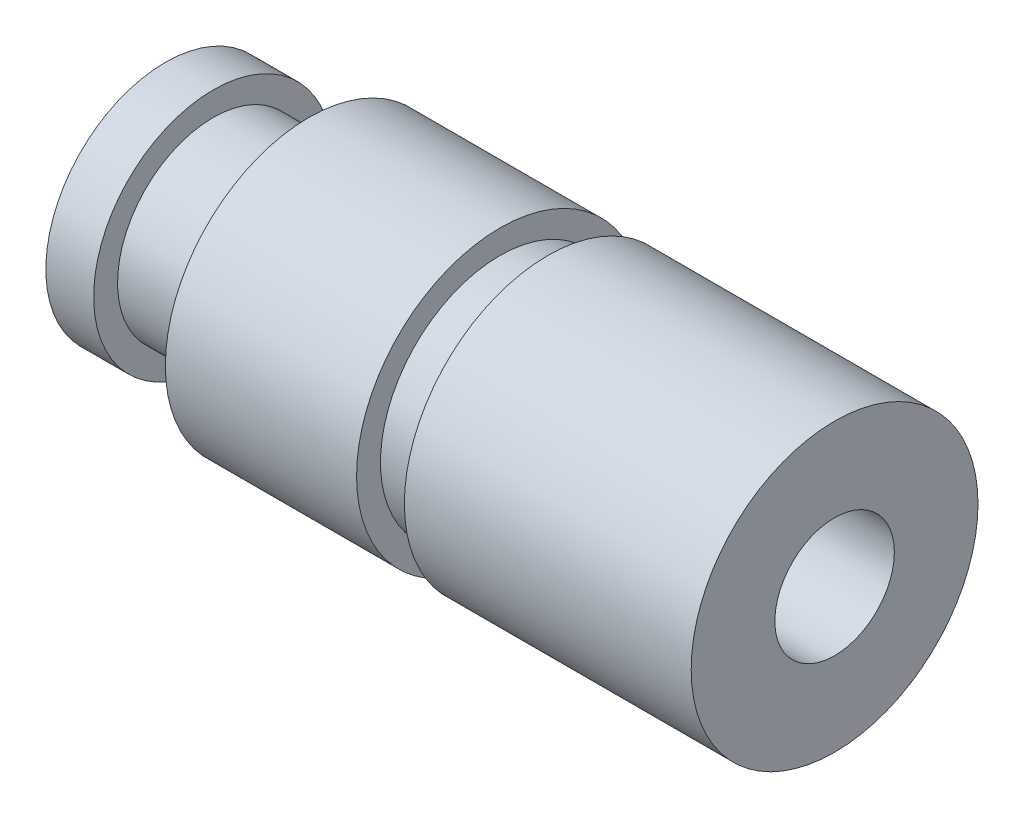
ISO-10303-21;
HEADER;
FILE_DESCRIPTION(('STEP AP214'),'2;1');
FILE_NAME('part.step','',(''),(''),'','','');
FILE_SCHEMA(('AUTOMOTIVE_DESIGN { 1 0 10303 214 1 1 1 1 }'));
ENDSEC;
DATA;
#1=APPLICATION_CONTEXT('core data for automotive mechanical design processes');
#2=APPLICATION_PROTOCOL_DEFINITION('international standard','automotive_design',2000,#1);
#3=PRODUCT_CONTEXT('',#1,'mechanical');
#4=PRODUCT('Part','Part','',(#3));
#5=PRODUCT_RELATED_PRODUCT_CATEGORY('part','',(#4));
#6=PRODUCT_DEFINITION_FORMATION('','',#4);
#7=PRODUCT_DEFINITION_CONTEXT('part definition',#1,'design');
#8=PRODUCT_DEFINITION('design','',#6,#7);
#9=PRODUCT_DEFINITION_SHAPE('','',#8);
#10=(LENGTH_UNIT() NAMED_UNIT(*) SI_UNIT(.MILLI.,.METRE.));
#11=(NAMED_UNIT(*) PLANE_ANGLE_UNIT() SI_UNIT($,.RADIAN.));
#12=(NAMED_UNIT(*) SI_UNIT($,.STERADIAN.) SOLID_ANGLE_UNIT());
#13=UNCERTAINTY_MEASURE_WITH_UNIT(LENGTH_MEASURE(1.E-05),#10,'distance_accuracy_value','');
#14=(GEOMETRIC_REPRESENTATION_CONTEXT(3) GLOBAL_UNCERTAINTY_ASSIGNED_CONTEXT((#13)) GLOBAL_UNIT_ASSIGNED_CONTEXT((#10,
#11,#12)) REPRESENTATION_CONTEXT('',''));
#15=CARTESIAN_POINT('',(0.,0.,0.));
#16=DIRECTION('',(0.,0.,1.));
#17=DIRECTION('',(1.,0.,0.));
#18=AXIS2_PLACEMENT_3D('',#15,#16,#17);
#19=CARTESIAN_POINT('',(0.,0.,0.));
#20=DIRECTION('',(-1.,0.,0.));
#21=DIRECTION('',(0.,-1.,0.));
#22=AXIS2_PLACEMENT_3D('',#19,#20,#21);
#23=PLANE('',#22);
#24=CARTESIAN_POINT('',(0.,0.,0.));
#25=DIRECTION('',(1.,0.,0.));
#26=DIRECTION('',(0.,1.,0.));
#27=AXIS2_PLACEMENT_3D('',#24,#25,#26);
#28=CIRCLE('',#27,2.5);
#29=CARTESIAN_POINT('',(0.,2.5,0.));
#30=VERTEX_POINT('',#29);
#31=EDGE_CURVE('E11',#30,#30,#28,.T.);
#32=ORIENTED_EDGE('',*,*,#31,.F.);
#33=EDGE_LOOP('',(#32));
#34=FACE_BOUND('',#33,.T.);
#35=ADVANCED_FACE('F42',(#34),#23,.T.);
#36=CARTESIAN_POINT('',(14.,0.,0.));
#37=DIRECTION('',(1.,0.,0.));
#38=DIRECTION('',(0.,1.,0.));
#39=AXIS2_PLACEMENT_3D('',#36,#37,#38);
#40=CYLINDRICAL_SURFACE('',#39,2.5);
#41=ORIENTED_EDGE('',*,*,#31,.T.);
#42=EDGE_LOOP('',(#41));
#43=FACE_BOUND('',#42,.T.);
#44=CARTESIAN_POINT('',(1.,0.,0.));
#45=DIRECTION('',(1.,0.,0.));
#46=DIRECTION('',(0.,1.,0.));
#47=AXIS2_PLACEMENT_3D('',#44,#45,#46);
#48=CIRCLE('',#47,2.5);
#49=CARTESIAN_POINT('',(1.,2.5,0.));
#50=VERTEX_POINT('',#49);
#51=EDGE_CURVE('E48',#50,#50,#48,.T.);
#52=ORIENTED_EDGE('',*,*,#51,.F.);
#53=EDGE_LOOP('',(#52));
#54=FACE_BOUND('',#53,.T.);
#55=ADVANCED_FACE('F89',(#43,#54),#40,.T.);
#56=CARTESIAN_POINT('',(1.,2.5,0.));
#57=DIRECTION('',(1.,0.,0.));
#58=DIRECTION('',(0.,1.,0.));
#59=AXIS2_PLACEMENT_3D('',#56,#57,#58);
#60=PLANE('',#59);
#61=ORIENTED_EDGE('',*,*,#51,.T.);
#62=EDGE_LOOP('',(#61));
#63=FACE_BOUND('',#62,.T.);
#64=CARTESIAN_POINT('',(1.,0.,0.));
#65=DIRECTION('',(1.,0.,0.));
#66=DIRECTION('',(0.,1.,0.));
#67=AXIS2_PLACEMENT_3D('',#64,#65,#66);
#68=CIRCLE('',#67,2.);
#69=CARTESIAN_POINT('',(1.,2.,0.));
#70=VERTEX_POINT('',#69);
#71=EDGE_CURVE('E81',#70,#70,#68,.T.);
#72=ORIENTED_EDGE('',*,*,#71,.F.);
#73=EDGE_LOOP('',(#72));
#74=FACE_BOUND('',#73,.T.);
#75=ADVANCED_FACE('F86',(#63,#74),#60,.T.);
#76=CARTESIAN_POINT('',(14.,0.,0.));
#77=DIRECTION('',(1.,0.,0.));
#78=DIRECTION('',(0.,1.,0.));
#79=AXIS2_PLACEMENT_3D('',#76,#77,#78);
#80=CYLINDRICAL_SURFACE('',#79,2.);
#81=ORIENTED_EDGE('',*,*,#71,.T.);
#82=EDGE_LOOP('',(#81));
#83=FACE_BOUND('',#82,.T.);
#84=CARTESIAN_POINT('',(3.,0.,0.));
#85=DIRECTION('',(1.,0.,0.));
#86=DIRECTION('',(0.,1.,0.));
#87=AXIS2_PLACEMENT_3D('',#84,#85,#86);
#88=CIRCLE('',#87,2.);
#89=CARTESIAN_POINT('',(3.,2.,0.));
#90=VERTEX_POINT('',#89);
#91=EDGE_CURVE('E78',#90,#90,#88,.T.);
#92=ORIENTED_EDGE('',*,*,#91,.F.);
#93=EDGE_LOOP('',(#92));
#94=FACE_BOUND('',#93,.T.);
#95=ADVANCED_FACE('F96',(#83,#94),#80,.T.);
#96=CARTESIAN_POINT('',(3.,2.,0.));
#97=DIRECTION('',(-1.,0.,0.));
#98=DIRECTION('',(0.,-1.,0.));
#99=AXIS2_PLACEMENT_3D('',#96,#97,#98);
#100=PLANE('',#99);
#101=ORIENTED_EDGE('',*,*,#91,.T.);
#102=EDGE_LOOP('',(#101));
#103=FACE_BOUND('',#102,.T.);
#104=CARTESIAN_POINT('',(3.,0.,0.));
#105=DIRECTION('',(1.,0.,0.));
#106=DIRECTION('',(0.,1.,0.));
#107=AXIS2_PLACEMENT_3D('',#104,#105,#106);
#108=CIRCLE('',#107,3.);
#109=CARTESIAN_POINT('',(3.,3.,0.));
#110=VERTEX_POINT('',#109);
#111=EDGE_CURVE('E75',#110,#110,#108,.T.);
#112=ORIENTED_EDGE('',*,*,#111,.F.);
#113=EDGE_LOOP('',(#112));
#114=FACE_BOUND('',#113,.T.);
#115=ADVANCED_FACE('F102',(#103,#114),#100,.T.);
#116=CARTESIAN_POINT('',(14.,0.,0.));
#117=DIRECTION('',(1.,0.,0.));
#118=DIRECTION('',(0.,1.,0.));
#119=AXIS2_PLACEMENT_3D('',#116,#117,#118);
#120=CYLINDRICAL_SURFACE('',#119,3.);
#121=CARTESIAN_POINT('',(7.,0.,0.));
#122=DIRECTION('',(-1.,0.,0.));
#123=DIRECTION('',(0.,-1.,0.));
#124=AXIS2_PLACEMENT_3D('',#121,#122,#123);
#125=CIRCLE('',#124,3.);
#126=CARTESIAN_POINT('',(7.,-3.,0.));
#127=VERTEX_POINT('',#126);
#128=EDGE_CURVE('E68',#127,#127,#125,.T.);
#129=ORIENTED_EDGE('',*,*,#128,.T.);
#130=EDGE_LOOP('',(#129));
#131=FACE_BOUND('',#130,.T.);
#132=ORIENTED_EDGE('',*,*,#111,.T.);
#133=EDGE_LOOP('',(#132));
#134=FACE_BOUND('',#133,.T.);
#135=ADVANCED_FACE('F106',(#131,#134),#120,.T.);
#136=CARTESIAN_POINT('',(8.,0.,0.));
#137=DIRECTION('',(-1.,0.,0.));
#138=DIRECTION('',(0.,-1.,0.));
#139=AXIS2_PLACEMENT_3D('',#136,#137,#138);
#140=PLANE('',#139);
#141=CARTESIAN_POINT('',(8.,0.,0.));
#142=DIRECTION('',(-1.,0.,0.));
#143=DIRECTION('',(0.,-1.,0.));
#144=AXIS2_PLACEMENT_3D('',#141,#142,#143);
#145=CIRCLE('',#144,2.5);
#146=CARTESIAN_POINT('',(8.,-2.5,0.));
#147=VERTEX_POINT('',#146);
#148=EDGE_CURVE('E133',#147,#147,#145,.T.);
#149=ORIENTED_EDGE('',*,*,#148,.F.);
#150=EDGE_LOOP('',(#149));
#151=FACE_BOUND('',#150,.T.);
#152=CARTESIAN_POINT('',(8.,0.,0.));
#153=DIRECTION('',(-1.,0.,0.));
#154=DIRECTION('',(0.,-1.,0.));
#155=AXIS2_PLACEMENT_3D('',#152,#153,#154);
#156=CIRCLE('',#155,3.);
#157=CARTESIAN_POINT('',(8.,-3.,0.));
#158=VERTEX_POINT('',#157);
#159=EDGE_CURVE('E62',#158,#158,#156,.T.);
#160=ORIENTED_EDGE('',*,*,#159,.T.);
#161=EDGE_LOOP('',(#160));
#162=FACE_BOUND('',#161,.T.);
#163=ADVANCED_FACE('F110',(#151,#162),#140,.T.);
#164=CARTESIAN_POINT('',(7.,0.,0.));
#165=DIRECTION('',(-1.,0.,0.));
#166=DIRECTION('',(0.,-1.,0.));
#167=AXIS2_PLACEMENT_3D('',#164,#165,#166);
#168=PLANE('',#167);
#169=CARTESIAN_POINT('',(7.,0.,0.));
#170=DIRECTION('',(-1.,0.,0.));
#171=DIRECTION('',(0.,-1.,0.));
#172=AXIS2_PLACEMENT_3D('',#169,#170,#171);
#173=CIRCLE('',#172,2.5);
#174=CARTESIAN_POINT('',(7.,-2.5,0.));
#175=VERTEX_POINT('',#174);
#176=EDGE_CURVE('E136',#175,#175,#173,.T.);
#177=ORIENTED_EDGE('',*,*,#176,.T.);
#178=EDGE_LOOP('',(#177));
#179=FACE_BOUND('',#178,.T.);
#180=ORIENTED_EDGE('',*,*,#128,.F.);
#181=EDGE_LOOP('',(#180));
#182=FACE_BOUND('',#181,.T.);
#183=ADVANCED_FACE('F119',(#179,#182),#168,.F.);
#184=CARTESIAN_POINT('',(8.,0.,0.));
#185=DIRECTION('',(-1.,0.,0.));
#186=DIRECTION('',(0.,-1.,0.));
#187=AXIS2_PLACEMENT_3D('',#184,#185,#186);
#188=CYLINDRICAL_SURFACE('',#187,2.5);
#189=ORIENTED_EDGE('',*,*,#148,.T.);
#190=EDGE_LOOP('',(#189));
#191=FACE_BOUND('',#190,.T.);
#192=ORIENTED_EDGE('',*,*,#176,.F.);
#193=EDGE_LOOP('',(#192));
#194=FACE_BOUND('',#193,.T.);
#195=ADVANCED_FACE('F55',(#191,#194),#188,.T.);
#196=CARTESIAN_POINT('',(5.5,0.,0.));
#197=DIRECTION('',(1.,0.,0.));
#198=DIRECTION('',(0.,0.,-1.));
#199=AXIS2_PLACEMENT_3D('',#196,#197,#198);
#200=CONICAL_SURFACE('',#199,1.25,1.02974425867665);
#201=CARTESIAN_POINT('',(4.74892422621555,0.,0.));
#202=VERTEX_POINT('',#201);
#203=VERTEX_LOOP('',#202);
#204=FACE_BOUND('',#203,.T.);
#205=CARTESIAN_POINT('',(5.5,0.,0.));
#206=DIRECTION('',(1.,0.,0.));
#207=DIRECTION('',(0.,0.,-1.));
#208=AXIS2_PLACEMENT_3D('',#205,#206,#207);
#209=CIRCLE('',#208,1.25);
#210=CARTESIAN_POINT('',(5.5,0.,-1.25));
#211=VERTEX_POINT('',#210);
#212=EDGE_CURVE('E59',#211,#211,#209,.T.);
#213=ORIENTED_EDGE('',*,*,#212,.T.);
#214=EDGE_LOOP('',(#213));
#215=FACE_BOUND('',#214,.T.);
#216=ADVANCED_FACE('F51',(#204,#215),#200,.F.);
#217=CARTESIAN_POINT('',(14.,0.,0.));
#218=DIRECTION('',(1.,0.,0.));
#219=DIRECTION('',(0.,0.,-1.));
#220=AXIS2_PLACEMENT_3D('',#217,#218,#219);
#221=CYLINDRICAL_SURFACE('',#220,1.24999999999999);
#222=ORIENTED_EDGE('',*,*,#212,.F.);
#223=EDGE_LOOP('',(#222));
#224=FACE_BOUND('',#223,.T.);
#225=CARTESIAN_POINT('',(14.,0.,0.));
#226=DIRECTION('',(1.,0.,0.));
#227=DIRECTION('',(0.,0.,-1.));
#228=AXIS2_PLACEMENT_3D('',#225,#226,#227);
#229=CIRCLE('',#228,1.24999999999999);
#230=CARTESIAN_POINT('',(14.,0.,-1.24999999999999));
#231=VERTEX_POINT('',#230);
#232=EDGE_CURVE('E61',#231,#231,#229,.T.);
#233=ORIENTED_EDGE('',*,*,#232,.T.);
#234=EDGE_LOOP('',(#233));
#235=FACE_BOUND('',#234,.T.);
#236=ADVANCED_FACE('F54',(#224,#235),#221,.F.);
#237=CARTESIAN_POINT('',(14.,3.,0.));
#238=DIRECTION('',(1.,0.,0.));
#239=DIRECTION('',(0.,1.,0.));
#240=AXIS2_PLACEMENT_3D('',#237,#238,#239);
#241=PLANE('',#240);
#242=ORIENTED_EDGE('',*,*,#232,.F.);
#243=EDGE_LOOP('',(#242));
#244=FACE_BOUND('',#243,.T.);
#245=CARTESIAN_POINT('',(14.,0.,0.));
#246=DIRECTION('',(1.,0.,0.));
#247=DIRECTION('',(0.,1.,0.));
#248=AXIS2_PLACEMENT_3D('',#245,#246,#247);
#249=CIRCLE('',#248,3.);
#250=CARTESIAN_POINT('',(14.,3.,0.));
#251=VERTEX_POINT('',#250);
#252=EDGE_CURVE('E65',#251,#251,#249,.T.);
#253=ORIENTED_EDGE('',*,*,#252,.T.);
#254=EDGE_LOOP('',(#253));
#255=FACE_BOUND('',#254,.T.);
#256=ADVANCED_FACE('F113',(#244,#255),#241,.T.);
#257=ORIENTED_EDGE('',*,*,#252,.F.);
#258=EDGE_LOOP('',(#257));
#259=FACE_BOUND('',#258,.T.);
#260=ORIENTED_EDGE('',*,*,#159,.F.);
#261=EDGE_LOOP('',(#260));
#262=FACE_BOUND('',#261,.T.);
#263=ADVANCED_FACE('F112',(#259,#262),#120,.T.);
#264=CLOSED_SHELL('',(#35,#55,#75,#95,#115,#135,#163,#183,#195,#216,#236,#256,#263));
#265=MANIFOLD_SOLID_BREP('B2',#264);
#266=ADVANCED_BREP_SHAPE_REPRESENTATION('',(#18,#265),#14);
#267=SHAPE_DEFINITION_REPRESENTATION(#9,#266);
ENDSEC;
END-ISO-10303-21;
